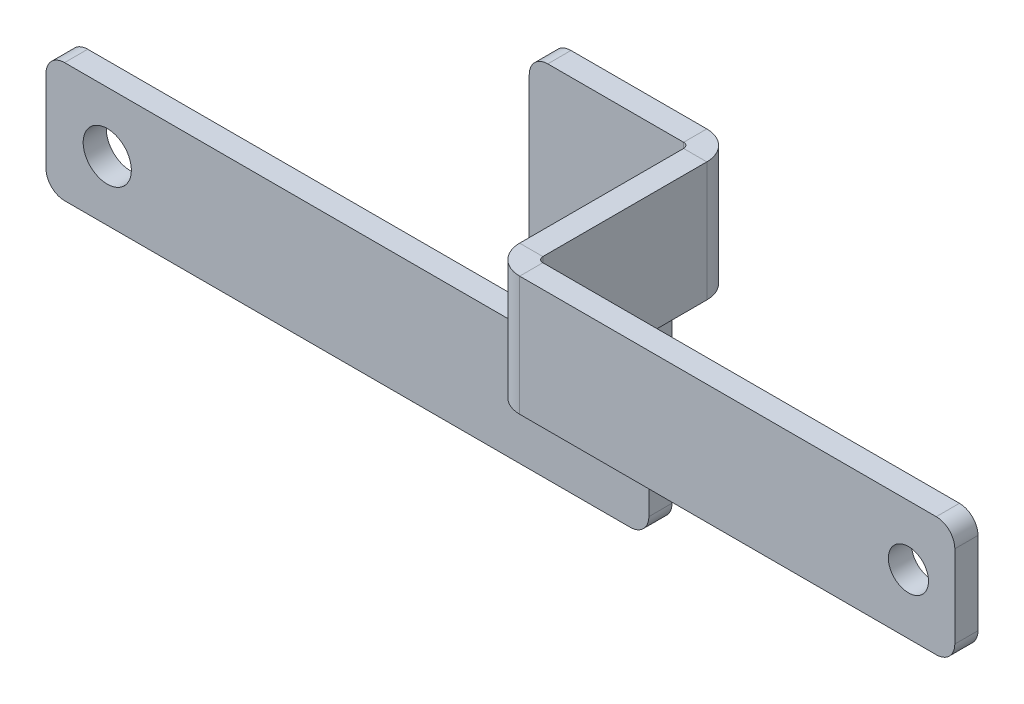
ISO-10303-21;
HEADER;
FILE_DESCRIPTION(('STEP AP214'),'2;1');
FILE_NAME('part.step','',(''),(''),'','','');
FILE_SCHEMA(('AUTOMOTIVE_DESIGN { 1 0 10303 214 1 1 1 1 }'));
ENDSEC;
DATA;
#1=APPLICATION_CONTEXT('core data for automotive mechanical design processes');
#2=APPLICATION_PROTOCOL_DEFINITION('international standard','automotive_design',2000,#1);
#3=PRODUCT_CONTEXT('',#1,'mechanical');
#4=PRODUCT('Part','Part','',(#3));
#5=PRODUCT_RELATED_PRODUCT_CATEGORY('part','',(#4));
#6=PRODUCT_DEFINITION_FORMATION('','',#4);
#7=PRODUCT_DEFINITION_CONTEXT('part definition',#1,'design');
#8=PRODUCT_DEFINITION('design','',#6,#7);
#9=PRODUCT_DEFINITION_SHAPE('','',#8);
#10=(LENGTH_UNIT() NAMED_UNIT(*) SI_UNIT(.MILLI.,.METRE.));
#11=(NAMED_UNIT(*) PLANE_ANGLE_UNIT() SI_UNIT($,.RADIAN.));
#12=(NAMED_UNIT(*) SI_UNIT($,.STERADIAN.) SOLID_ANGLE_UNIT());
#13=UNCERTAINTY_MEASURE_WITH_UNIT(LENGTH_MEASURE(1.E-05),#10,'distance_accuracy_value','');
#14=(GEOMETRIC_REPRESENTATION_CONTEXT(3) GLOBAL_UNCERTAINTY_ASSIGNED_CONTEXT((#13)) GLOBAL_UNIT_ASSIGNED_CONTEXT((#10,
#11,#12)) REPRESENTATION_CONTEXT('',''));
#15=CARTESIAN_POINT('',(0.,0.,0.));
#16=DIRECTION('',(0.,0.,1.));
#17=DIRECTION('',(1.,0.,0.));
#18=AXIS2_PLACEMENT_3D('',#15,#16,#17);
#19=CARTESIAN_POINT('',(65.8241,-45.5626000012021,0.));
#20=DIRECTION('',(0.,1.,0.));
#21=DIRECTION('',(0.,0.,1.));
#22=AXIS2_PLACEMENT_3D('',#19,#20,#21);
#23=PLANE('',#22);
#24=DIRECTION('',(-1.,0.,0.));
#25=VECTOR('',#24,1.);
#26=CARTESIAN_POINT('',(65.8241000000001,-45.5626000012021,23.1902));
#27=LINE('',#26,#25);
#28=CARTESIAN_POINT('',(65.8241000000001,-45.5626000012021,23.1902));
#29=VERTEX_POINT('',#28);
#30=CARTESIAN_POINT('',(62.6491000000001,-45.5626000012021,23.1902));
#31=VERTEX_POINT('',#30);
#32=EDGE_CURVE('E262',#29,#31,#27,.T.);
#33=ORIENTED_EDGE('',*,*,#32,.T.);
#34=DIRECTION('',(0.,0.,1.));
#35=VECTOR('',#34,1.);
#36=CARTESIAN_POINT('',(62.6491,-45.5626000012021,0.));
#37=LINE('',#36,#35);
#38=CARTESIAN_POINT('',(62.6491,-45.562600001202,0.736599999999997));
#39=VERTEX_POINT('',#38);
#40=EDGE_CURVE('E283',#31,#39,#37,.F.);
#41=ORIENTED_EDGE('',*,*,#40,.T.);
#42=DIRECTION('',(-1.,0.,0.));
#43=VECTOR('',#42,1.);
#44=CARTESIAN_POINT('',(65.8241,-45.5626000012021,0.736599999999986));
#45=LINE('',#44,#43);
#46=CARTESIAN_POINT('',(65.8241,-45.562600001202,0.736599999999986));
#47=VERTEX_POINT('',#46);
#48=EDGE_CURVE('E272',#39,#47,#45,.F.);
#49=ORIENTED_EDGE('',*,*,#48,.T.);
#50=DIRECTION('',(0.,0.,-1.));
#51=VECTOR('',#50,1.);
#52=CARTESIAN_POINT('',(65.8241,-45.5626000012021,-2.26544738483615E-13));
#53=LINE('',#52,#51);
#54=EDGE_CURVE('E278',#29,#47,#53,.T.);
#55=ORIENTED_EDGE('',*,*,#54,.F.);
#56=EDGE_LOOP('',(#33,#41,#49,#55));
#57=FACE_BOUND('',#56,.T.);
#58=ADVANCED_FACE('F58',(#57),#23,.F.);
#59=CARTESIAN_POINT('',(65.8241000000001,-29.1846000012021,23.9268));
#60=DIRECTION('',(0.,-1.,0.));
#61=DIRECTION('',(0.,0.,-1.));
#62=AXIS2_PLACEMENT_3D('',#59,#60,#61);
#63=PLANE('',#62);
#64=DIRECTION('',(-1.,0.,0.));
#65=VECTOR('',#64,1.);
#66=CARTESIAN_POINT('',(65.8241000000001,-29.1846000012021,23.1902));
#67=LINE('',#66,#65);
#68=CARTESIAN_POINT('',(65.8241000000001,-29.1846000012021,23.1902));
#69=VERTEX_POINT('',#68);
#70=CARTESIAN_POINT('',(62.6491000000001,-29.1846000012021,23.1902));
#71=VERTEX_POINT('',#70);
#72=EDGE_CURVE('E269',#69,#71,#67,.T.);
#73=ORIENTED_EDGE('',*,*,#72,.F.);
#74=DIRECTION('',(0.,0.,1.));
#75=VECTOR('',#74,1.);
#76=CARTESIAN_POINT('',(65.8241,-29.1846000012021,-2.30776579829644E-13));
#77=LINE('',#76,#75);
#78=CARTESIAN_POINT('',(65.8241,-29.1846000012021,0.736599999999986));
#79=VERTEX_POINT('',#78);
#80=EDGE_CURVE('E274',#79,#69,#77,.T.);
#81=ORIENTED_EDGE('',*,*,#80,.F.);
#82=DIRECTION('',(-1.,0.,0.));
#83=VECTOR('',#82,1.);
#84=CARTESIAN_POINT('',(62.6491,-29.1846000012021,0.736599999999997));
#85=LINE('',#84,#83);
#86=CARTESIAN_POINT('',(62.6491,-29.1846000012021,0.736599999999997));
#87=VERTEX_POINT('',#86);
#88=EDGE_CURVE('E288',#87,#79,#85,.F.);
#89=ORIENTED_EDGE('',*,*,#88,.F.);
#90=DIRECTION('',(0.,0.,-1.));
#91=VECTOR('',#90,1.);
#92=CARTESIAN_POINT('',(62.6491000000001,-29.1846000012021,23.9268));
#93=LINE('',#92,#91);
#94=EDGE_CURVE('E280',#87,#71,#93,.F.);
#95=ORIENTED_EDGE('',*,*,#94,.T.);
#96=EDGE_LOOP('',(#73,#81,#89,#95));
#97=FACE_BOUND('',#96,.T.);
#98=ADVANCED_FACE('F508',(#97),#63,.F.);
#99=CARTESIAN_POINT('',(65.8241,0.,-2.26544738483615E-13));
#100=DIRECTION('',(-1.,0.,0.));
#101=DIRECTION('',(0.,0.,1.));
#102=AXIS2_PLACEMENT_3D('',#99,#100,#101);
#103=PLANE('',#102);
#104=DIRECTION('',(0.,-1.,0.));
#105=VECTOR('',#104,1.);
#106=CARTESIAN_POINT('',(65.8241000000001,-45.5626000012021,23.1902));
#107=LINE('',#106,#105);
#108=EDGE_CURVE('E266',#29,#69,#107,.F.);
#109=ORIENTED_EDGE('',*,*,#108,.F.);
#110=ORIENTED_EDGE('',*,*,#54,.T.);
#111=DIRECTION('',(0.,1.,0.));
#112=VECTOR('',#111,1.);
#113=CARTESIAN_POINT('',(65.8241,-45.5626000012021,0.736599999999986));
#114=LINE('',#113,#112);
#115=EDGE_CURVE('E285',#79,#47,#114,.F.);
#116=ORIENTED_EDGE('',*,*,#115,.F.);
#117=ORIENTED_EDGE('',*,*,#80,.T.);
#118=EDGE_LOOP('',(#109,#110,#116,#117));
#119=FACE_BOUND('',#118,.T.);
#120=ADVANCED_FACE('F505',(#119),#103,.F.);
#121=CARTESIAN_POINT('',(62.6491,0.,-2.15459285232788E-13));
#122=DIRECTION('',(-1.,0.,0.));
#123=DIRECTION('',(0.,0.,1.));
#124=AXIS2_PLACEMENT_3D('',#121,#122,#123);
#125=PLANE('',#124);
#126=ORIENTED_EDGE('',*,*,#40,.F.);
#127=DIRECTION('',(0.,-1.,0.));
#128=VECTOR('',#127,1.);
#129=CARTESIAN_POINT('',(62.6491000000001,-45.5626000012021,23.1902));
#130=LINE('',#129,#128);
#131=EDGE_CURVE('E228',#31,#71,#130,.F.);
#132=ORIENTED_EDGE('',*,*,#131,.T.);
#133=ORIENTED_EDGE('',*,*,#94,.F.);
#134=DIRECTION('',(0.,1.,0.));
#135=VECTOR('',#134,1.);
#136=CARTESIAN_POINT('',(62.6491,-45.5626000012021,0.736599999999997));
#137=LINE('',#136,#135);
#138=EDGE_CURVE('E291',#39,#87,#137,.T.);
#139=ORIENTED_EDGE('',*,*,#138,.F.);
#140=EDGE_LOOP('',(#126,#132,#133,#139));
#141=FACE_BOUND('',#140,.T.);
#142=ADVANCED_FACE('F516',(#141),#125,.T.);
#143=CARTESIAN_POINT('',(-25.39999999,-78.5016000012037,-3.175));
#144=DIRECTION('',(-1.,0.,0.));
#145=DIRECTION('',(0.,0.,1.));
#146=AXIS2_PLACEMENT_3D('',#143,#144,#145);
#147=PLANE('',#146);
#148=DIRECTION('',(0.,-1.,0.));
#149=VECTOR('',#148,1.);
#150=CARTESIAN_POINT('',(-25.39999999,-78.5016000012037,-3.175));
#151=LINE('',#150,#149);
#152=CARTESIAN_POINT('',(-25.39999999,-64.6636000012037,-3.175));
#153=VERTEX_POINT('',#152);
#154=CARTESIAN_POINT('',(-25.39999999,-75.9616000012037,-3.175));
#155=VERTEX_POINT('',#154);
#156=EDGE_CURVE('E307',#153,#155,#151,.T.);
#157=ORIENTED_EDGE('',*,*,#156,.T.);
#158=DIRECTION('',(0.,0.,1.));
#159=VECTOR('',#158,1.);
#160=CARTESIAN_POINT('',(-25.39999999,-75.9616000012037,-3.175));
#161=LINE('',#160,#159);
#162=CARTESIAN_POINT('',(-25.39999999,-75.9616000012037,0.));
#163=VERTEX_POINT('',#162);
#164=EDGE_CURVE('E365',#155,#163,#161,.T.);
#165=ORIENTED_EDGE('',*,*,#164,.T.);
#166=DIRECTION('',(0.,-1.,0.));
#167=VECTOR('',#166,1.);
#168=CARTESIAN_POINT('',(-25.39999999,-78.5016000012037,0.));
#169=LINE('',#168,#167);
#170=CARTESIAN_POINT('',(-25.39999999,-64.6636000012037,0.));
#171=VERTEX_POINT('',#170);
#172=EDGE_CURVE('E298',#171,#163,#169,.T.);
#173=ORIENTED_EDGE('',*,*,#172,.F.);
#174=DIRECTION('',(0.,0.,1.));
#175=VECTOR('',#174,1.);
#176=CARTESIAN_POINT('',(-25.39999999,-64.6636000012037,-3.175));
#177=LINE('',#176,#175);
#178=EDGE_CURVE('E356',#171,#153,#177,.F.);
#179=ORIENTED_EDGE('',*,*,#178,.T.);
#180=EDGE_LOOP('',(#157,#165,#173,#179));
#181=FACE_BOUND('',#180,.T.);
#182=ADVANCED_FACE('F465',(#181),#147,.T.);
#183=CARTESIAN_POINT('',(40.772,-62.1236000012037,-3.175));
#184=DIRECTION('',(0.,1.,0.));
#185=DIRECTION('',(-1.,0.,0.));
#186=AXIS2_PLACEMENT_3D('',#183,#184,#185);
#187=PLANE('',#186);
#188=DIRECTION('',(-1.,0.,0.));
#189=VECTOR('',#188,1.);
#190=CARTESIAN_POINT('',(40.772,-62.1236000012037,-3.175));
#191=LINE('',#190,#189);
#192=CARTESIAN_POINT('',(38.232,-62.1236000012037,-3.175));
#193=VERTEX_POINT('',#192);
#194=CARTESIAN_POINT('',(-22.85999999,-62.1236000012037,-3.175));
#195=VERTEX_POINT('',#194);
#196=EDGE_CURVE('E328',#193,#195,#191,.T.);
#197=ORIENTED_EDGE('',*,*,#196,.T.);
#198=DIRECTION('',(0.,0.,1.));
#199=VECTOR('',#198,1.);
#200=CARTESIAN_POINT('',(-22.85999999,-62.1236000012037,-3.175));
#201=LINE('',#200,#199);
#202=CARTESIAN_POINT('',(-22.85999999,-62.1236000012037,0.));
#203=VERTEX_POINT('',#202);
#204=EDGE_CURVE('E391',#195,#203,#201,.T.);
#205=ORIENTED_EDGE('',*,*,#204,.T.);
#206=DIRECTION('',(-1.,0.,0.));
#207=VECTOR('',#206,1.);
#208=CARTESIAN_POINT('',(40.772,-62.1236000012037,0.));
#209=LINE('',#208,#207);
#210=CARTESIAN_POINT('',(38.232,-62.1236000012037,0.));
#211=VERTEX_POINT('',#210);
#212=EDGE_CURVE('E311',#211,#203,#209,.T.);
#213=ORIENTED_EDGE('',*,*,#212,.F.);
#214=DIRECTION('',(0.,0.,1.));
#215=VECTOR('',#214,1.);
#216=CARTESIAN_POINT('',(38.232,-62.1236000012037,-3.175));
#217=LINE('',#216,#215);
#218=EDGE_CURVE('E389',#211,#193,#217,.F.);
#219=ORIENTED_EDGE('',*,*,#218,.T.);
#220=EDGE_LOOP('',(#197,#205,#213,#219));
#221=FACE_BOUND('',#220,.T.);
#222=ADVANCED_FACE('F474',(#221),#187,.T.);
#223=CARTESIAN_POINT('',(40.772,-45.5626000012021,-3.175));
#224=DIRECTION('',(-1.,0.,0.));
#225=DIRECTION('',(0.,0.,1.));
#226=AXIS2_PLACEMENT_3D('',#223,#224,#225);
#227=PLANE('',#226);
#228=DIRECTION('',(0.,-1.,0.));
#229=VECTOR('',#228,1.);
#230=CARTESIAN_POINT('',(40.772,-29.1846000012021,-3.175));
#231=LINE('',#230,#229);
#232=CARTESIAN_POINT('',(40.772,-31.7246000012021,-3.175));
#233=VERTEX_POINT('',#232);
#234=CARTESIAN_POINT('',(40.772,-59.5836000012037,-3.175));
#235=VERTEX_POINT('',#234);
#236=EDGE_CURVE('E325',#233,#235,#231,.T.);
#237=ORIENTED_EDGE('',*,*,#236,.T.);
#238=DIRECTION('',(0.,0.,1.));
#239=VECTOR('',#238,1.);
#240=CARTESIAN_POINT('',(40.772,-59.5836000012037,0.));
#241=LINE('',#240,#239);
#242=CARTESIAN_POINT('',(40.772,-59.5836000012037,0.));
#243=VERTEX_POINT('',#242);
#244=EDGE_CURVE('E396',#235,#243,#241,.T.);
#245=ORIENTED_EDGE('',*,*,#244,.T.);
#246=DIRECTION('',(0.,-1.,0.));
#247=VECTOR('',#246,1.);
#248=CARTESIAN_POINT('',(40.772,-45.5626000012021,0.));
#249=LINE('',#248,#247);
#250=CARTESIAN_POINT('',(40.772,-31.7246000012021,0.));
#251=VERTEX_POINT('',#250);
#252=EDGE_CURVE('E348',#251,#243,#249,.T.);
#253=ORIENTED_EDGE('',*,*,#252,.F.);
#254=DIRECTION('',(0.,0.,1.));
#255=VECTOR('',#254,1.);
#256=CARTESIAN_POINT('',(40.772,-31.7246000012021,-3.175));
#257=LINE('',#256,#255);
#258=EDGE_CURVE('E394',#251,#233,#257,.F.);
#259=ORIENTED_EDGE('',*,*,#258,.T.);
#260=EDGE_LOOP('',(#237,#245,#253,#259));
#261=FACE_BOUND('',#260,.T.);
#262=ADVANCED_FACE('F483',(#261),#227,.T.);
#263=CARTESIAN_POINT('',(40.772,-29.1846000012021,-3.175));
#264=DIRECTION('',(0.,1.,0.));
#265=DIRECTION('',(0.,0.,1.));
#266=AXIS2_PLACEMENT_3D('',#263,#264,#265);
#267=PLANE('',#266);
#268=DIRECTION('',(-1.,0.,0.));
#269=VECTOR('',#268,1.);
#270=CARTESIAN_POINT('',(40.772,-29.1846000012021,-3.175));
#271=LINE('',#270,#269);
#272=CARTESIAN_POINT('',(61.9125,-29.1846000012021,-3.175));
#273=VERTEX_POINT('',#272);
#274=CARTESIAN_POINT('',(43.312,-29.1846000012021,-3.175));
#275=VERTEX_POINT('',#274);
#276=EDGE_CURVE('E322',#273,#275,#271,.T.);
#277=ORIENTED_EDGE('',*,*,#276,.T.);
#278=DIRECTION('',(0.,0.,1.));
#279=VECTOR('',#278,1.);
#280=CARTESIAN_POINT('',(43.312,-29.1846000012021,-3.175));
#281=LINE('',#280,#279);
#282=CARTESIAN_POINT('',(43.312,-29.1846000012021,0.));
#283=VERTEX_POINT('',#282);
#284=EDGE_CURVE('E406',#275,#283,#281,.T.);
#285=ORIENTED_EDGE('',*,*,#284,.T.);
#286=DIRECTION('',(-1.,0.,0.));
#287=VECTOR('',#286,1.);
#288=CARTESIAN_POINT('',(40.772,-29.1846000012021,0.));
#289=LINE('',#288,#287);
#290=CARTESIAN_POINT('',(61.9125,-29.1846000012021,0.));
#291=VERTEX_POINT('',#290);
#292=EDGE_CURVE('E345',#291,#283,#289,.T.);
#293=ORIENTED_EDGE('',*,*,#292,.F.);
#294=DIRECTION('',(0.,0.,1.));
#295=VECTOR('',#294,1.);
#296=CARTESIAN_POINT('',(61.9125,-29.1846000012021,-3.175));
#297=LINE('',#296,#295);
#298=EDGE_CURVE('E353',#273,#291,#297,.T.);
#299=ORIENTED_EDGE('',*,*,#298,.F.);
#300=EDGE_LOOP('',(#277,#285,#293,#299));
#301=FACE_BOUND('',#300,.T.);
#302=ADVANCED_FACE('F491',(#301),#267,.T.);
#303=CARTESIAN_POINT('',(57.15000001,-45.5626000012021,-3.175));
#304=DIRECTION('',(0.,-1.,0.));
#305=DIRECTION('',(0.,0.,-1.));
#306=AXIS2_PLACEMENT_3D('',#303,#304,#305);
#307=PLANE('',#306);
#308=DIRECTION('',(1.,0.,0.));
#309=VECTOR('',#308,1.);
#310=CARTESIAN_POINT('',(57.15000001,-45.5626000012021,0.));
#311=LINE('',#310,#309);
#312=CARTESIAN_POINT('',(59.69000001,-45.5626000012021,0.));
#313=VERTEX_POINT('',#312);
#314=CARTESIAN_POINT('',(61.9125,-45.5626000012021,0.));
#315=VERTEX_POINT('',#314);
#316=EDGE_CURVE('E340',#313,#315,#311,.T.);
#317=ORIENTED_EDGE('',*,*,#316,.F.);
#318=DIRECTION('',(0.,0.,1.));
#319=VECTOR('',#318,1.);
#320=CARTESIAN_POINT('',(59.69000001,-45.5626000012021,-3.175));
#321=LINE('',#320,#319);
#322=CARTESIAN_POINT('',(59.69000001,-45.5626000012021,-3.175));
#323=VERTEX_POINT('',#322);
#324=EDGE_CURVE('E404',#313,#323,#321,.F.);
#325=ORIENTED_EDGE('',*,*,#324,.T.);
#326=DIRECTION('',(1.,0.,0.));
#327=VECTOR('',#326,1.);
#328=CARTESIAN_POINT('',(57.15000001,-45.5626000012021,-3.175));
#329=LINE('',#328,#327);
#330=CARTESIAN_POINT('',(61.9125,-45.5626000012021,-3.175));
#331=VERTEX_POINT('',#330);
#332=EDGE_CURVE('E317',#323,#331,#329,.T.);
#333=ORIENTED_EDGE('',*,*,#332,.T.);
#334=DIRECTION('',(0.,0.,1.));
#335=VECTOR('',#334,1.);
#336=CARTESIAN_POINT('',(61.9125,-45.5626000012021,-3.175));
#337=LINE('',#336,#335);
#338=EDGE_CURVE('E331',#331,#315,#337,.T.);
#339=ORIENTED_EDGE('',*,*,#338,.T.);
#340=EDGE_LOOP('',(#317,#325,#333,#339));
#341=FACE_BOUND('',#340,.T.);
#342=ADVANCED_FACE('F436',(#341),#307,.T.);
#343=CARTESIAN_POINT('',(57.15000001,-45.5626000012021,-3.175));
#344=DIRECTION('',(1.,0.,0.));
#345=DIRECTION('',(0.,1.,0.));
#346=AXIS2_PLACEMENT_3D('',#343,#344,#345);
#347=PLANE('',#346);
#348=DIRECTION('',(0.,1.,0.));
#349=VECTOR('',#348,1.);
#350=CARTESIAN_POINT('',(57.15000001,-45.5626000012021,0.));
#351=LINE('',#350,#349);
#352=CARTESIAN_POINT('',(57.15000001,-75.9616000012037,0.));
#353=VERTEX_POINT('',#352);
#354=CARTESIAN_POINT('',(57.15000001,-48.1026000012021,0.));
#355=VERTEX_POINT('',#354);
#356=EDGE_CURVE('E337',#353,#355,#351,.T.);
#357=ORIENTED_EDGE('',*,*,#356,.F.);
#358=DIRECTION('',(0.,0.,1.));
#359=VECTOR('',#358,1.);
#360=CARTESIAN_POINT('',(57.15000001,-75.9616000012037,-3.175));
#361=LINE('',#360,#359);
#362=CARTESIAN_POINT('',(57.15000001,-75.9616000012037,-3.175));
#363=VERTEX_POINT('',#362);
#364=EDGE_CURVE('E402',#353,#363,#361,.F.);
#365=ORIENTED_EDGE('',*,*,#364,.T.);
#366=DIRECTION('',(0.,1.,0.));
#367=VECTOR('',#366,1.);
#368=CARTESIAN_POINT('',(57.15000001,-45.5626000012021,-3.175));
#369=LINE('',#368,#367);
#370=CARTESIAN_POINT('',(57.15000001,-48.1026000012021,-3.175));
#371=VERTEX_POINT('',#370);
#372=EDGE_CURVE('E314',#363,#371,#369,.T.);
#373=ORIENTED_EDGE('',*,*,#372,.T.);
#374=DIRECTION('',(0.,0.,1.));
#375=VECTOR('',#374,1.);
#376=CARTESIAN_POINT('',(57.15000001,-48.1026000012021,0.));
#377=LINE('',#376,#375);
#378=EDGE_CURVE('E399',#371,#355,#377,.T.);
#379=ORIENTED_EDGE('',*,*,#378,.T.);
#380=EDGE_LOOP('',(#357,#365,#373,#379));
#381=FACE_BOUND('',#380,.T.);
#382=ADVANCED_FACE('F449',(#381),#347,.T.);
#383=CARTESIAN_POINT('',(57.15000001,-78.5016000012037,-3.175));
#384=DIRECTION('',(0.,-1.,0.));
#385=DIRECTION('',(0.,0.,-1.));
#386=AXIS2_PLACEMENT_3D('',#383,#384,#385);
#387=PLANE('',#386);
#388=DIRECTION('',(1.,0.,0.));
#389=VECTOR('',#388,1.);
#390=CARTESIAN_POINT('',(57.15000001,-78.5016000012037,0.));
#391=LINE('',#390,#389);
#392=CARTESIAN_POINT('',(-22.85999999,-78.5016000012037,0.));
#393=VERTEX_POINT('',#392);
#394=CARTESIAN_POINT('',(54.61000001,-78.5016000012037,0.));
#395=VERTEX_POINT('',#394);
#396=EDGE_CURVE('E334',#393,#395,#391,.T.);
#397=ORIENTED_EDGE('',*,*,#396,.F.);
#398=DIRECTION('',(0.,0.,1.));
#399=VECTOR('',#398,1.);
#400=CARTESIAN_POINT('',(-22.85999999,-78.5016000012037,-3.175));
#401=LINE('',#400,#399);
#402=CARTESIAN_POINT('',(-22.85999999,-78.5016000012037,-3.175));
#403=VERTEX_POINT('',#402);
#404=EDGE_CURVE('E379',#393,#403,#401,.F.);
#405=ORIENTED_EDGE('',*,*,#404,.T.);
#406=DIRECTION('',(1.,0.,0.));
#407=VECTOR('',#406,1.);
#408=CARTESIAN_POINT('',(57.15000001,-78.5016000012037,-3.175));
#409=LINE('',#408,#407);
#410=CARTESIAN_POINT('',(54.61000001,-78.5016000012037,-3.175));
#411=VERTEX_POINT('',#410);
#412=EDGE_CURVE('E310',#403,#411,#409,.T.);
#413=ORIENTED_EDGE('',*,*,#412,.T.);
#414=DIRECTION('',(0.,0.,1.));
#415=VECTOR('',#414,1.);
#416=CARTESIAN_POINT('',(54.61000001,-78.5016000012037,-3.175));
#417=LINE('',#416,#415);
#418=EDGE_CURVE('E376',#411,#395,#417,.T.);
#419=ORIENTED_EDGE('',*,*,#418,.T.);
#420=EDGE_LOOP('',(#397,#405,#413,#419));
#421=FACE_BOUND('',#420,.T.);
#422=ADVANCED_FACE('F457',(#421),#387,.T.);
#423=CARTESIAN_POINT('',(0.,0.,-3.175));
#424=DIRECTION('',(0.,0.,1.));
#425=DIRECTION('',(1.,0.,0.));
#426=AXIS2_PLACEMENT_3D('',#423,#424,#425);
#427=PLANE('',#426);
#428=CARTESIAN_POINT('',(-17.0118999999998,-70.3126000012033,-3.175));
#429=DIRECTION('',(0.,0.,1.));
#430=DIRECTION('',(1.,0.,0.));
#431=AXIS2_PLACEMENT_3D('',#428,#429,#430);
#432=CIRCLE('',#431,3.3);
#433=CARTESIAN_POINT('',(-13.7118999999998,-70.3126000012033,-3.175));
#434=VERTEX_POINT('',#433);
#435=EDGE_CURVE('E584',#434,#434,#432,.T.);
#436=ORIENTED_EDGE('',*,*,#435,.T.);
#437=EDGE_LOOP('',(#436));
#438=FACE_BOUND('',#437,.T.);
#439=ORIENTED_EDGE('',*,*,#412,.F.);
#440=CARTESIAN_POINT('',(-22.85999999,-75.9616000012037,-3.175));
#441=DIRECTION('',(0.,0.,1.));
#442=DIRECTION('',(1.,0.,0.));
#443=AXIS2_PLACEMENT_3D('',#440,#441,#442);
#444=CIRCLE('',#443,2.54);
#445=EDGE_CURVE('E387',#403,#155,#444,.F.);
#446=ORIENTED_EDGE('',*,*,#445,.T.);
#447=ORIENTED_EDGE('',*,*,#156,.F.);
#448=CARTESIAN_POINT('',(-22.85999999,-64.6636000012037,-3.175));
#449=DIRECTION('',(0.,0.,1.));
#450=DIRECTION('',(1.,0.,0.));
#451=AXIS2_PLACEMENT_3D('',#448,#449,#450);
#452=CIRCLE('',#451,2.54);
#453=EDGE_CURVE('E385',#153,#195,#452,.F.);
#454=ORIENTED_EDGE('',*,*,#453,.T.);
#455=ORIENTED_EDGE('',*,*,#196,.F.);
#456=CARTESIAN_POINT('',(38.232,-59.5836000012037,-3.175));
#457=DIRECTION('',(0.,0.,1.));
#458=DIRECTION('',(1.,0.,0.));
#459=AXIS2_PLACEMENT_3D('',#456,#457,#458);
#460=CIRCLE('',#459,2.54);
#461=EDGE_CURVE('E427',#193,#235,#460,.T.);
#462=ORIENTED_EDGE('',*,*,#461,.T.);
#463=ORIENTED_EDGE('',*,*,#236,.F.);
#464=CARTESIAN_POINT('',(43.312,-31.7246000012021,-3.175));
#465=DIRECTION('',(0.,0.,1.));
#466=DIRECTION('',(1.,0.,0.));
#467=AXIS2_PLACEMENT_3D('',#464,#465,#466);
#468=CIRCLE('',#467,2.54);
#469=EDGE_CURVE('E381',#233,#275,#468,.F.);
#470=ORIENTED_EDGE('',*,*,#469,.T.);
#471=ORIENTED_EDGE('',*,*,#276,.F.);
#472=DIRECTION('',(0.,1.,0.));
#473=VECTOR('',#472,1.);
#474=CARTESIAN_POINT('',(61.9125,-45.5626000012021,-3.175));
#475=LINE('',#474,#473);
#476=EDGE_CURVE('E319',#331,#273,#475,.T.);
#477=ORIENTED_EDGE('',*,*,#476,.F.);
#478=ORIENTED_EDGE('',*,*,#332,.F.);
#479=CARTESIAN_POINT('',(59.69000001,-48.1026000012021,-3.175));
#480=DIRECTION('',(0.,0.,1.));
#481=DIRECTION('',(1.,0.,0.));
#482=AXIS2_PLACEMENT_3D('',#479,#480,#481);
#483=CIRCLE('',#482,2.54);
#484=EDGE_CURVE('E13',#323,#371,#483,.T.);
#485=ORIENTED_EDGE('',*,*,#484,.T.);
#486=ORIENTED_EDGE('',*,*,#372,.F.);
#487=CARTESIAN_POINT('',(54.61000001,-75.9616000012037,-3.175));
#488=DIRECTION('',(0.,0.,1.));
#489=DIRECTION('',(1.,0.,0.));
#490=AXIS2_PLACEMENT_3D('',#487,#488,#489);
#491=CIRCLE('',#490,2.54);
#492=EDGE_CURVE('E383',#363,#411,#491,.F.);
#493=ORIENTED_EDGE('',*,*,#492,.T.);
#494=EDGE_LOOP('',(#439,#446,#447,#454,#455,#462,#463,#470,#471,#477,#478,#485,#486,#493));
#495=FACE_BOUND('',#494,.T.);
#496=ADVANCED_FACE('F445',(#438,#495),#427,.F.);
#497=CARTESIAN_POINT('',(0.,0.,0.));
#498=DIRECTION('',(0.,0.,1.));
#499=DIRECTION('',(1.,0.,0.));
#500=AXIS2_PLACEMENT_3D('',#497,#498,#499);
#501=PLANE('',#500);
#502=CARTESIAN_POINT('',(-17.0118999999998,-70.3126000012033,0.));
#503=DIRECTION('',(0.,0.,1.));
#504=DIRECTION('',(1.,0.,0.));
#505=AXIS2_PLACEMENT_3D('',#502,#503,#504);
#506=CIRCLE('',#505,3.3);
#507=CARTESIAN_POINT('',(-13.7118999999998,-70.3126000012033,0.));
#508=VERTEX_POINT('',#507);
#509=EDGE_CURVE('E587',#508,#508,#506,.T.);
#510=ORIENTED_EDGE('',*,*,#509,.F.);
#511=EDGE_LOOP('',(#510));
#512=FACE_BOUND('',#511,.T.);
#513=ORIENTED_EDGE('',*,*,#172,.T.);
#514=CARTESIAN_POINT('',(-22.85999999,-75.9616000012037,0.));
#515=DIRECTION('',(0.,0.,1.));
#516=DIRECTION('',(1.,0.,0.));
#517=AXIS2_PLACEMENT_3D('',#514,#515,#516);
#518=CIRCLE('',#517,2.54);
#519=EDGE_CURVE('E374',#163,#393,#518,.T.);
#520=ORIENTED_EDGE('',*,*,#519,.T.);
#521=ORIENTED_EDGE('',*,*,#396,.T.);
#522=CARTESIAN_POINT('',(54.61000001,-75.9616000012037,0.));
#523=DIRECTION('',(0.,0.,1.));
#524=DIRECTION('',(1.,0.,0.));
#525=AXIS2_PLACEMENT_3D('',#522,#523,#524);
#526=CIRCLE('',#525,2.54);
#527=EDGE_CURVE('E370',#395,#353,#526,.T.);
#528=ORIENTED_EDGE('',*,*,#527,.T.);
#529=ORIENTED_EDGE('',*,*,#356,.T.);
#530=CARTESIAN_POINT('',(59.69000001,-48.1026000012021,0.));
#531=DIRECTION('',(0.,0.,1.));
#532=DIRECTION('',(1.,0.,0.));
#533=AXIS2_PLACEMENT_3D('',#530,#531,#532);
#534=CIRCLE('',#533,2.54);
#535=EDGE_CURVE('E66',#355,#313,#534,.F.);
#536=ORIENTED_EDGE('',*,*,#535,.T.);
#537=ORIENTED_EDGE('',*,*,#316,.T.);
#538=DIRECTION('',(0.,1.,0.));
#539=VECTOR('',#538,1.);
#540=CARTESIAN_POINT('',(61.9125,-45.5626000012021,0.));
#541=LINE('',#540,#539);
#542=EDGE_CURVE('E342',#315,#291,#541,.T.);
#543=ORIENTED_EDGE('',*,*,#542,.T.);
#544=ORIENTED_EDGE('',*,*,#292,.T.);
#545=CARTESIAN_POINT('',(43.312,-31.7246000012021,0.));
#546=DIRECTION('',(0.,0.,1.));
#547=DIRECTION('',(1.,0.,0.));
#548=AXIS2_PLACEMENT_3D('',#545,#546,#547);
#549=CIRCLE('',#548,2.54);
#550=EDGE_CURVE('E368',#283,#251,#549,.T.);
#551=ORIENTED_EDGE('',*,*,#550,.T.);
#552=ORIENTED_EDGE('',*,*,#252,.T.);
#553=CARTESIAN_POINT('',(38.232,-59.5836000012037,0.));
#554=DIRECTION('',(0.,0.,1.));
#555=DIRECTION('',(1.,0.,0.));
#556=AXIS2_PLACEMENT_3D('',#553,#554,#555);
#557=CIRCLE('',#556,2.54);
#558=EDGE_CURVE('E425',#243,#211,#557,.F.);
#559=ORIENTED_EDGE('',*,*,#558,.T.);
#560=ORIENTED_EDGE('',*,*,#212,.T.);
#561=CARTESIAN_POINT('',(-22.85999999,-64.6636000012037,0.));
#562=DIRECTION('',(0.,0.,1.));
#563=DIRECTION('',(1.,0.,0.));
#564=AXIS2_PLACEMENT_3D('',#561,#562,#563);
#565=CIRCLE('',#564,2.54);
#566=EDGE_CURVE('E372',#203,#171,#565,.T.);
#567=ORIENTED_EDGE('',*,*,#566,.T.);
#568=EDGE_LOOP('',(#513,#520,#521,#528,#529,#536,#537,#543,#544,#551,#552,#559,#560,#567));
#569=FACE_BOUND('',#568,.T.);
#570=ADVANCED_FACE('F430',(#512,#569),#501,.T.);
#571=CARTESIAN_POINT('',(61.9125,-45.5626000012021,0.7366));
#572=DIRECTION('',(0.,-1.,0.));
#573=DIRECTION('',(0.,0.,-1.));
#574=AXIS2_PLACEMENT_3D('',#571,#572,#573);
#575=PLANE('',#574);
#576=ORIENTED_EDGE('',*,*,#48,.F.);
#577=CARTESIAN_POINT('',(61.9125,-45.5626000012021,0.7366));
#578=DIRECTION('',(0.,1.,0.));
#579=DIRECTION('',(0.,0.,1.));
#580=AXIS2_PLACEMENT_3D('',#577,#578,#579);
#581=CIRCLE('',#580,0.736599999999997);
#582=EDGE_CURVE('E302',#315,#39,#581,.F.);
#583=ORIENTED_EDGE('',*,*,#582,.F.);
#584=ORIENTED_EDGE('',*,*,#338,.F.);
#585=CARTESIAN_POINT('',(61.9125,-45.562600001202,0.7366));
#586=DIRECTION('',(0.,1.,0.));
#587=DIRECTION('',(0.,0.,1.));
#588=AXIS2_PLACEMENT_3D('',#585,#586,#587);
#589=CIRCLE('',#588,3.9116);
#590=EDGE_CURVE('E295',#331,#47,#589,.F.);
#591=ORIENTED_EDGE('',*,*,#590,.T.);
#592=EDGE_LOOP('',(#576,#583,#584,#591));
#593=FACE_BOUND('',#592,.T.);
#594=ADVANCED_FACE('F522',(#593),#575,.T.);
#595=CARTESIAN_POINT('',(61.9125,-29.1846000012021,0.7366));
#596=DIRECTION('',(0.,-1.,0.));
#597=DIRECTION('',(0.,0.,-1.));
#598=AXIS2_PLACEMENT_3D('',#595,#596,#597);
#599=PLANE('',#598);
#600=CARTESIAN_POINT('',(61.9125,-29.1846000012021,0.7366));
#601=DIRECTION('',(0.,1.,0.));
#602=DIRECTION('',(0.,0.,1.));
#603=AXIS2_PLACEMENT_3D('',#600,#601,#602);
#604=CIRCLE('',#603,0.736599999999997);
#605=EDGE_CURVE('E277',#87,#291,#604,.T.);
#606=ORIENTED_EDGE('',*,*,#605,.F.);
#607=ORIENTED_EDGE('',*,*,#88,.T.);
#608=CARTESIAN_POINT('',(61.9125,-29.1846000012021,0.7366));
#609=DIRECTION('',(0.,1.,0.));
#610=DIRECTION('',(0.,0.,1.));
#611=AXIS2_PLACEMENT_3D('',#608,#609,#610);
#612=CIRCLE('',#611,3.9116);
#613=EDGE_CURVE('E299',#79,#273,#612,.T.);
#614=ORIENTED_EDGE('',*,*,#613,.T.);
#615=ORIENTED_EDGE('',*,*,#298,.T.);
#616=EDGE_LOOP('',(#606,#607,#614,#615));
#617=FACE_BOUND('',#616,.T.);
#618=ADVANCED_FACE('F497',(#617),#599,.F.);
#619=CARTESIAN_POINT('',(61.9125,-29.1846000012021,0.7366));
#620=DIRECTION('',(0.,1.,0.));
#621=DIRECTION('',(1.,0.,0.));
#622=AXIS2_PLACEMENT_3D('',#619,#620,#621);
#623=CYLINDRICAL_SURFACE('',#622,3.9116);
#624=ORIENTED_EDGE('',*,*,#476,.T.);
#625=ORIENTED_EDGE('',*,*,#613,.F.);
#626=ORIENTED_EDGE('',*,*,#115,.T.);
#627=ORIENTED_EDGE('',*,*,#590,.F.);
#628=EDGE_LOOP('',(#624,#625,#626,#627));
#629=FACE_BOUND('',#628,.T.);
#630=ADVANCED_FACE('F496',(#629),#623,.T.);
#631=CARTESIAN_POINT('',(61.9125,-29.1846000012021,0.7366));
#632=DIRECTION('',(0.,1.,0.));
#633=DIRECTION('',(1.,0.,0.));
#634=AXIS2_PLACEMENT_3D('',#631,#632,#633);
#635=CYLINDRICAL_SURFACE('',#634,0.736599999999997);
#636=ORIENTED_EDGE('',*,*,#542,.F.);
#637=ORIENTED_EDGE('',*,*,#582,.T.);
#638=ORIENTED_EDGE('',*,*,#138,.T.);
#639=ORIENTED_EDGE('',*,*,#605,.T.);
#640=EDGE_LOOP('',(#636,#637,#638,#639));
#641=FACE_BOUND('',#640,.T.);
#642=ADVANCED_FACE('F524',(#641),#635,.F.);
#643=CARTESIAN_POINT('',(66.5607000000001,-29.1846000012021,23.1902));
#644=DIRECTION('',(0.,1.,0.));
#645=DIRECTION('',(0.,0.,1.));
#646=AXIS2_PLACEMENT_3D('',#643,#644,#645);
#647=PLANE('',#646);
#648=DIRECTION('',(0.,0.,1.));
#649=VECTOR('',#648,1.);
#650=CARTESIAN_POINT('',(66.5607000000001,-29.1846000012021,23.9268));
#651=LINE('',#650,#649);
#652=CARTESIAN_POINT('',(66.5607000000001,-29.1846000012021,23.9268));
#653=VERTEX_POINT('',#652);
#654=CARTESIAN_POINT('',(66.5607000000001,-29.1846000012021,27.1018));
#655=VERTEX_POINT('',#654);
#656=EDGE_CURVE('E362',#653,#655,#651,.T.);
#657=ORIENTED_EDGE('',*,*,#656,.F.);
#658=CARTESIAN_POINT('',(66.5607000000001,-29.1846000012021,23.1902));
#659=DIRECTION('',(0.,-1.,0.));
#660=DIRECTION('',(0.,0.,-1.));
#661=AXIS2_PLACEMENT_3D('',#658,#659,#660);
#662=CIRCLE('',#661,0.736600000000004);
#663=EDGE_CURVE('E231',#69,#653,#662,.F.);
#664=ORIENTED_EDGE('',*,*,#663,.F.);
#665=ORIENTED_EDGE('',*,*,#72,.T.);
#666=CARTESIAN_POINT('',(66.5607000000001,-29.1846000012021,23.1902));
#667=DIRECTION('',(0.,-1.,0.));
#668=DIRECTION('',(0.,0.,-1.));
#669=AXIS2_PLACEMENT_3D('',#666,#667,#668);
#670=CIRCLE('',#669,3.9116);
#671=EDGE_CURVE('E261',#71,#655,#670,.F.);
#672=ORIENTED_EDGE('',*,*,#671,.T.);
#673=EDGE_LOOP('',(#657,#664,#665,#672));
#674=FACE_BOUND('',#673,.T.);
#675=ADVANCED_FACE('F512',(#674),#647,.T.);
#676=CARTESIAN_POINT('',(66.5607000000001,-45.5626000012021,23.1902));
#677=DIRECTION('',(0.,1.,0.));
#678=DIRECTION('',(0.,0.,1.));
#679=AXIS2_PLACEMENT_3D('',#676,#677,#678);
#680=PLANE('',#679);
#681=CARTESIAN_POINT('',(66.5607000000001,-45.5626000012021,23.1902));
#682=DIRECTION('',(0.,-1.,0.));
#683=DIRECTION('',(0.,0.,-1.));
#684=AXIS2_PLACEMENT_3D('',#681,#682,#683);
#685=CIRCLE('',#684,0.736600000000004);
#686=CARTESIAN_POINT('',(66.5607000000001,-45.5626000012021,23.9268));
#687=VERTEX_POINT('',#686);
#688=EDGE_CURVE('E238',#687,#29,#685,.T.);
#689=ORIENTED_EDGE('',*,*,#688,.F.);
#690=DIRECTION('',(0.,0.,1.));
#691=VECTOR('',#690,1.);
#692=CARTESIAN_POINT('',(66.5607000000001,-45.5626000012021,23.9268));
#693=LINE('',#692,#691);
#694=CARTESIAN_POINT('',(66.5607000000001,-45.5626000012021,27.1018));
#695=VERTEX_POINT('',#694);
#696=EDGE_CURVE('E235',#687,#695,#693,.T.);
#697=ORIENTED_EDGE('',*,*,#696,.T.);
#698=CARTESIAN_POINT('',(66.5607000000001,-45.5626000012021,23.1902));
#699=DIRECTION('',(0.,-1.,0.));
#700=DIRECTION('',(0.,0.,-1.));
#701=AXIS2_PLACEMENT_3D('',#698,#699,#700);
#702=CIRCLE('',#701,3.9116);
#703=EDGE_CURVE('E221',#695,#31,#702,.T.);
#704=ORIENTED_EDGE('',*,*,#703,.T.);
#705=ORIENTED_EDGE('',*,*,#32,.F.);
#706=EDGE_LOOP('',(#689,#697,#704,#705));
#707=FACE_BOUND('',#706,.T.);
#708=ADVANCED_FACE('F236',(#707),#680,.F.);
#709=CARTESIAN_POINT('',(66.5607000000001,-45.5626000012021,23.1902));
#710=DIRECTION('',(0.,-1.,0.));
#711=DIRECTION('',(0.,0.,1.));
#712=AXIS2_PLACEMENT_3D('',#709,#710,#711);
#713=CYLINDRICAL_SURFACE('',#712,3.9116);
#714=ORIENTED_EDGE('',*,*,#131,.F.);
#715=ORIENTED_EDGE('',*,*,#703,.F.);
#716=DIRECTION('',(0.,1.,0.));
#717=VECTOR('',#716,1.);
#718=CARTESIAN_POINT('',(66.5607000000001,0.,27.1018));
#719=LINE('',#718,#717);
#720=EDGE_CURVE('E225',#695,#655,#719,.T.);
#721=ORIENTED_EDGE('',*,*,#720,.T.);
#722=ORIENTED_EDGE('',*,*,#671,.F.);
#723=EDGE_LOOP('',(#714,#715,#721,#722));
#724=FACE_BOUND('',#723,.T.);
#725=ADVANCED_FACE('F223',(#724),#713,.T.);
#726=CARTESIAN_POINT('',(66.5607000000001,-45.5626000012021,23.1902));
#727=DIRECTION('',(0.,-1.,0.));
#728=DIRECTION('',(0.,0.,1.));
#729=AXIS2_PLACEMENT_3D('',#726,#727,#728);
#730=CYLINDRICAL_SURFACE('',#729,0.736600000000004);
#731=ORIENTED_EDGE('',*,*,#108,.T.);
#732=ORIENTED_EDGE('',*,*,#663,.T.);
#733=DIRECTION('',(0.,-1.,0.));
#734=VECTOR('',#733,1.);
#735=CARTESIAN_POINT('',(66.5607000000001,-29.1846000012021,23.9268));
#736=LINE('',#735,#734);
#737=EDGE_CURVE('E240',#653,#687,#736,.T.);
#738=ORIENTED_EDGE('',*,*,#737,.T.);
#739=ORIENTED_EDGE('',*,*,#688,.T.);
#740=EDGE_LOOP('',(#731,#732,#738,#739));
#741=FACE_BOUND('',#740,.T.);
#742=ADVANCED_FACE('F547',(#741),#730,.F.);
#743=CARTESIAN_POINT('',(65.8241000000001,-29.1846000012021,27.1018));
#744=DIRECTION('',(0.,-1.,0.));
#745=DIRECTION('',(0.,0.,-1.));
#746=AXIS2_PLACEMENT_3D('',#743,#744,#745);
#747=PLANE('',#746);
#748=DIRECTION('',(-1.,0.,0.));
#749=VECTOR('',#748,1.);
#750=CARTESIAN_POINT('',(65.8241000000001,-29.1846000012021,27.1018));
#751=LINE('',#750,#749);
#752=CARTESIAN_POINT('',(123.6091,-29.1846000012021,27.1018));
#753=VERTEX_POINT('',#752);
#754=EDGE_CURVE('E245',#753,#655,#751,.T.);
#755=ORIENTED_EDGE('',*,*,#754,.F.);
#756=DIRECTION('',(0.,0.,-1.));
#757=VECTOR('',#756,1.);
#758=CARTESIAN_POINT('',(123.6091,-29.1846000012021,27.1018));
#759=LINE('',#758,#757);
#760=CARTESIAN_POINT('',(123.6091,-29.1846000012021,23.9268));
#761=VERTEX_POINT('',#760);
#762=EDGE_CURVE('E422',#753,#761,#759,.T.);
#763=ORIENTED_EDGE('',*,*,#762,.T.);
#764=DIRECTION('',(-1.,0.,0.));
#765=VECTOR('',#764,1.);
#766=CARTESIAN_POINT('',(65.8241000000001,-29.1846000012021,23.9268));
#767=LINE('',#766,#765);
#768=EDGE_CURVE('E246',#761,#653,#767,.T.);
#769=ORIENTED_EDGE('',*,*,#768,.T.);
#770=ORIENTED_EDGE('',*,*,#656,.T.);
#771=EDGE_LOOP('',(#755,#763,#769,#770));
#772=FACE_BOUND('',#771,.T.);
#773=ADVANCED_FACE('F550',(#772),#747,.F.);
#774=CARTESIAN_POINT('',(126.1491,-45.5626000012021,27.1018));
#775=DIRECTION('',(0.,1.,0.));
#776=DIRECTION('',(0.,0.,1.));
#777=AXIS2_PLACEMENT_3D('',#774,#775,#776);
#778=PLANE('',#777);
#779=DIRECTION('',(1.,0.,0.));
#780=VECTOR('',#779,1.);
#781=CARTESIAN_POINT('',(126.1491,-45.5626000012021,23.9268));
#782=LINE('',#781,#780);
#783=CARTESIAN_POINT('',(123.6091,-45.5626000012021,23.9268));
#784=VERTEX_POINT('',#783);
#785=EDGE_CURVE('E256',#687,#784,#782,.T.);
#786=ORIENTED_EDGE('',*,*,#785,.T.);
#787=DIRECTION('',(0.,0.,-1.));
#788=VECTOR('',#787,1.);
#789=CARTESIAN_POINT('',(123.6091,-45.5626000012021,27.1018));
#790=LINE('',#789,#788);
#791=CARTESIAN_POINT('',(123.6091,-45.5626000012021,27.1018));
#792=VERTEX_POINT('',#791);
#793=EDGE_CURVE('E81',#784,#792,#790,.F.);
#794=ORIENTED_EDGE('',*,*,#793,.T.);
#795=DIRECTION('',(1.,0.,0.));
#796=VECTOR('',#795,1.);
#797=CARTESIAN_POINT('',(126.1491,-45.5626000012021,27.1018));
#798=LINE('',#797,#796);
#799=EDGE_CURVE('E243',#695,#792,#798,.T.);
#800=ORIENTED_EDGE('',*,*,#799,.F.);
#801=ORIENTED_EDGE('',*,*,#696,.F.);
#802=EDGE_LOOP('',(#786,#794,#800,#801));
#803=FACE_BOUND('',#802,.T.);
#804=ADVANCED_FACE('F248',(#803),#778,.F.);
#805=CARTESIAN_POINT('',(0.,0.,27.1018));
#806=DIRECTION('',(0.,0.,-1.));
#807=DIRECTION('',(-1.,0.,0.));
#808=AXIS2_PLACEMENT_3D('',#805,#806,#807);
#809=PLANE('',#808);
#810=CARTESIAN_POINT('',(119.7991,-37.373600001202,27.1018));
#811=DIRECTION('',(0.,0.,1.));
#812=DIRECTION('',(1.,0.,0.));
#813=AXIS2_PLACEMENT_3D('',#810,#811,#812);
#814=CIRCLE('',#813,2.75);
#815=CARTESIAN_POINT('',(122.5491,-37.373600001202,27.1018));
#816=VERTEX_POINT('',#815);
#817=EDGE_CURVE('E363',#816,#816,#814,.T.);
#818=ORIENTED_EDGE('',*,*,#817,.F.);
#819=EDGE_LOOP('',(#818));
#820=FACE_BOUND('',#819,.T.);
#821=ORIENTED_EDGE('',*,*,#799,.T.);
#822=CARTESIAN_POINT('',(123.6091,-43.0226000012021,27.1018));
#823=DIRECTION('',(0.,0.,-1.));
#824=DIRECTION('',(-1.,0.,0.));
#825=AXIS2_PLACEMENT_3D('',#822,#823,#824);
#826=CIRCLE('',#825,2.54);
#827=CARTESIAN_POINT('',(126.1491,-43.0226000012021,27.1018));
#828=VERTEX_POINT('',#827);
#829=EDGE_CURVE('E420',#792,#828,#826,.F.);
#830=ORIENTED_EDGE('',*,*,#829,.T.);
#831=DIRECTION('',(0.,1.,0.));
#832=VECTOR('',#831,1.);
#833=CARTESIAN_POINT('',(126.1491,-29.1846000012021,27.1018));
#834=LINE('',#833,#832);
#835=CARTESIAN_POINT('',(126.1491,-31.7246000012021,27.1018));
#836=VERTEX_POINT('',#835);
#837=EDGE_CURVE('E249',#828,#836,#834,.T.);
#838=ORIENTED_EDGE('',*,*,#837,.T.);
#839=CARTESIAN_POINT('',(123.6091,-31.7246000012021,27.1018));
#840=DIRECTION('',(0.,0.,-1.));
#841=DIRECTION('',(-1.,0.,0.));
#842=AXIS2_PLACEMENT_3D('',#839,#840,#841);
#843=CIRCLE('',#842,2.54);
#844=EDGE_CURVE('E73',#836,#753,#843,.F.);
#845=ORIENTED_EDGE('',*,*,#844,.T.);
#846=ORIENTED_EDGE('',*,*,#754,.T.);
#847=ORIENTED_EDGE('',*,*,#720,.F.);
#848=EDGE_LOOP('',(#821,#830,#838,#845,#846,#847));
#849=FACE_BOUND('',#848,.T.);
#850=ADVANCED_FACE('F242',(#820,#849),#809,.F.);
#851=CARTESIAN_POINT('',(0.,0.,23.9268));
#852=DIRECTION('',(0.,0.,-1.));
#853=DIRECTION('',(-1.,0.,0.));
#854=AXIS2_PLACEMENT_3D('',#851,#852,#853);
#855=PLANE('',#854);
#856=CARTESIAN_POINT('',(119.7991,-37.373600001202,23.9268));
#857=DIRECTION('',(0.,0.,-1.));
#858=DIRECTION('',(-1.,0.,0.));
#859=AXIS2_PLACEMENT_3D('',#856,#857,#858);
#860=CIRCLE('',#859,2.75);
#861=CARTESIAN_POINT('',(117.0491,-37.373600001202,23.9268));
#862=VERTEX_POINT('',#861);
#863=EDGE_CURVE('E359',#862,#862,#860,.T.);
#864=ORIENTED_EDGE('',*,*,#863,.F.);
#865=EDGE_LOOP('',(#864));
#866=FACE_BOUND('',#865,.T.);
#867=DIRECTION('',(0.,1.,0.));
#868=VECTOR('',#867,1.);
#869=CARTESIAN_POINT('',(126.1491,-29.1846000012021,23.9268));
#870=LINE('',#869,#868);
#871=CARTESIAN_POINT('',(126.1491,-43.0226000012021,23.9268));
#872=VERTEX_POINT('',#871);
#873=CARTESIAN_POINT('',(126.1491,-31.7246000012021,23.9268));
#874=VERTEX_POINT('',#873);
#875=EDGE_CURVE('E252',#872,#874,#870,.T.);
#876=ORIENTED_EDGE('',*,*,#875,.F.);
#877=CARTESIAN_POINT('',(123.6091,-43.0226000012021,23.9268));
#878=DIRECTION('',(0.,0.,-1.));
#879=DIRECTION('',(-1.,0.,0.));
#880=AXIS2_PLACEMENT_3D('',#877,#878,#879);
#881=CIRCLE('',#880,2.54);
#882=EDGE_CURVE('E416',#872,#784,#881,.T.);
#883=ORIENTED_EDGE('',*,*,#882,.T.);
#884=ORIENTED_EDGE('',*,*,#785,.F.);
#885=ORIENTED_EDGE('',*,*,#737,.F.);
#886=ORIENTED_EDGE('',*,*,#768,.F.);
#887=CARTESIAN_POINT('',(123.6091,-31.7246000012021,23.9268));
#888=DIRECTION('',(0.,0.,-1.));
#889=DIRECTION('',(-1.,0.,0.));
#890=AXIS2_PLACEMENT_3D('',#887,#888,#889);
#891=CIRCLE('',#890,2.54);
#892=EDGE_CURVE('E414',#761,#874,#891,.T.);
#893=ORIENTED_EDGE('',*,*,#892,.T.);
#894=EDGE_LOOP('',(#876,#883,#884,#885,#886,#893));
#895=FACE_BOUND('',#894,.T.);
#896=ADVANCED_FACE('F563',(#866,#895),#855,.T.);
#897=CARTESIAN_POINT('',(126.1491,-29.1846000012021,27.1018));
#898=DIRECTION('',(-1.,0.,0.));
#899=DIRECTION('',(0.,0.,1.));
#900=AXIS2_PLACEMENT_3D('',#897,#898,#899);
#901=PLANE('',#900);
#902=ORIENTED_EDGE('',*,*,#837,.F.);
#903=DIRECTION('',(0.,0.,-1.));
#904=VECTOR('',#903,1.);
#905=CARTESIAN_POINT('',(126.1491,-43.0226000012021,27.1018));
#906=LINE('',#905,#904);
#907=EDGE_CURVE('E411',#828,#872,#906,.T.);
#908=ORIENTED_EDGE('',*,*,#907,.T.);
#909=ORIENTED_EDGE('',*,*,#875,.T.);
#910=DIRECTION('',(0.,0.,-1.));
#911=VECTOR('',#910,1.);
#912=CARTESIAN_POINT('',(126.1491,-31.7246000012021,27.1018));
#913=LINE('',#912,#911);
#914=EDGE_CURVE('E409',#874,#836,#913,.F.);
#915=ORIENTED_EDGE('',*,*,#914,.T.);
#916=EDGE_LOOP('',(#902,#908,#909,#915));
#917=FACE_BOUND('',#916,.T.);
#918=ADVANCED_FACE('F559',(#917),#901,.F.);
#919=CARTESIAN_POINT('',(119.7991,-37.373600001202,27.1018));
#920=DIRECTION('',(0.,0.,1.));
#921=DIRECTION('',(1.,0.,0.));
#922=AXIS2_PLACEMENT_3D('',#919,#920,#921);
#923=CYLINDRICAL_SURFACE('',#922,2.75);
#924=ORIENTED_EDGE('',*,*,#863,.T.);
#925=EDGE_LOOP('',(#924));
#926=FACE_BOUND('',#925,.T.);
#927=ORIENTED_EDGE('',*,*,#817,.T.);
#928=EDGE_LOOP('',(#927));
#929=FACE_BOUND('',#928,.T.);
#930=ADVANCED_FACE('F562',(#926,#929),#923,.F.);
#931=CARTESIAN_POINT('',(-17.0118999999998,-70.3126000012033,0.));
#932=DIRECTION('',(0.,0.,1.));
#933=DIRECTION('',(1.,0.,0.));
#934=AXIS2_PLACEMENT_3D('',#931,#932,#933);
#935=CYLINDRICAL_SURFACE('',#934,3.3);
#936=ORIENTED_EDGE('',*,*,#435,.F.);
#937=EDGE_LOOP('',(#936));
#938=FACE_BOUND('',#937,.T.);
#939=ORIENTED_EDGE('',*,*,#509,.T.);
#940=EDGE_LOOP('',(#939));
#941=FACE_BOUND('',#940,.T.);
#942=ADVANCED_FACE('F573',(#938,#941),#935,.F.);
#943=CARTESIAN_POINT('',(-22.85999999,-75.9616000012037,-3.175));
#944=DIRECTION('',(0.,0.,1.));
#945=DIRECTION('',(1.,0.,0.));
#946=AXIS2_PLACEMENT_3D('',#943,#944,#945);
#947=CYLINDRICAL_SURFACE('',#946,2.54);
#948=ORIENTED_EDGE('',*,*,#445,.F.);
#949=ORIENTED_EDGE('',*,*,#404,.F.);
#950=ORIENTED_EDGE('',*,*,#519,.F.);
#951=ORIENTED_EDGE('',*,*,#164,.F.);
#952=EDGE_LOOP('',(#948,#949,#950,#951));
#953=FACE_BOUND('',#952,.T.);
#954=ADVANCED_FACE('F460',(#953),#947,.T.);
#955=CARTESIAN_POINT('',(-22.85999999,-64.6636000012037,-3.175));
#956=DIRECTION('',(0.,0.,1.));
#957=DIRECTION('',(1.,0.,0.));
#958=AXIS2_PLACEMENT_3D('',#955,#956,#957);
#959=CYLINDRICAL_SURFACE('',#958,2.54);
#960=ORIENTED_EDGE('',*,*,#453,.F.);
#961=ORIENTED_EDGE('',*,*,#178,.F.);
#962=ORIENTED_EDGE('',*,*,#566,.F.);
#963=ORIENTED_EDGE('',*,*,#204,.F.);
#964=EDGE_LOOP('',(#960,#961,#962,#963));
#965=FACE_BOUND('',#964,.T.);
#966=ADVANCED_FACE('F469',(#965),#959,.T.);
#967=CARTESIAN_POINT('',(38.232,-59.5836000012037,-3.175));
#968=DIRECTION('',(0.,0.,-1.));
#969=DIRECTION('',(-1.,0.,0.));
#970=AXIS2_PLACEMENT_3D('',#967,#968,#969);
#971=CYLINDRICAL_SURFACE('',#970,2.54);
#972=ORIENTED_EDGE('',*,*,#461,.F.);
#973=ORIENTED_EDGE('',*,*,#218,.F.);
#974=ORIENTED_EDGE('',*,*,#558,.F.);
#975=ORIENTED_EDGE('',*,*,#244,.F.);
#976=EDGE_LOOP('',(#972,#973,#974,#975));
#977=FACE_BOUND('',#976,.T.);
#978=ADVANCED_FACE('F478',(#977),#971,.F.);
#979=CARTESIAN_POINT('',(54.61000001,-75.9616000012037,-3.175));
#980=DIRECTION('',(0.,0.,1.));
#981=DIRECTION('',(1.,0.,0.));
#982=AXIS2_PLACEMENT_3D('',#979,#980,#981);
#983=CYLINDRICAL_SURFACE('',#982,2.54);
#984=ORIENTED_EDGE('',*,*,#492,.F.);
#985=ORIENTED_EDGE('',*,*,#364,.F.);
#986=ORIENTED_EDGE('',*,*,#527,.F.);
#987=ORIENTED_EDGE('',*,*,#418,.F.);
#988=EDGE_LOOP('',(#984,#985,#986,#987));
#989=FACE_BOUND('',#988,.T.);
#990=ADVANCED_FACE('F452',(#989),#983,.T.);
#991=CARTESIAN_POINT('',(59.69000001,-48.1026000012021,-3.175));
#992=DIRECTION('',(0.,0.,-1.));
#993=DIRECTION('',(-1.,0.,0.));
#994=AXIS2_PLACEMENT_3D('',#991,#992,#993);
#995=CYLINDRICAL_SURFACE('',#994,2.54);
#996=ORIENTED_EDGE('',*,*,#484,.F.);
#997=ORIENTED_EDGE('',*,*,#324,.F.);
#998=ORIENTED_EDGE('',*,*,#535,.F.);
#999=ORIENTED_EDGE('',*,*,#378,.F.);
#1000=EDGE_LOOP('',(#996,#997,#998,#999));
#1001=FACE_BOUND('',#1000,.T.);
#1002=ADVANCED_FACE('F441',(#1001),#995,.F.);
#1003=CARTESIAN_POINT('',(43.312,-31.7246000012021,-3.175));
#1004=DIRECTION('',(0.,0.,1.));
#1005=DIRECTION('',(1.,0.,0.));
#1006=AXIS2_PLACEMENT_3D('',#1003,#1004,#1005);
#1007=CYLINDRICAL_SURFACE('',#1006,2.54);
#1008=ORIENTED_EDGE('',*,*,#469,.F.);
#1009=ORIENTED_EDGE('',*,*,#258,.F.);
#1010=ORIENTED_EDGE('',*,*,#550,.F.);
#1011=ORIENTED_EDGE('',*,*,#284,.F.);
#1012=EDGE_LOOP('',(#1008,#1009,#1010,#1011));
#1013=FACE_BOUND('',#1012,.T.);
#1014=ADVANCED_FACE('F487',(#1013),#1007,.T.);
#1015=CARTESIAN_POINT('',(123.6091,-43.0226000012021,27.1018));
#1016=DIRECTION('',(0.,0.,-1.));
#1017=DIRECTION('',(-1.,0.,0.));
#1018=AXIS2_PLACEMENT_3D('',#1015,#1016,#1017);
#1019=CYLINDRICAL_SURFACE('',#1018,2.54);
#1020=ORIENTED_EDGE('',*,*,#829,.F.);
#1021=ORIENTED_EDGE('',*,*,#793,.F.);
#1022=ORIENTED_EDGE('',*,*,#882,.F.);
#1023=ORIENTED_EDGE('',*,*,#907,.F.);
#1024=EDGE_LOOP('',(#1020,#1021,#1022,#1023));
#1025=FACE_BOUND('',#1024,.T.);
#1026=ADVANCED_FACE('F601',(#1025),#1019,.T.);
#1027=CARTESIAN_POINT('',(123.6091,-31.7246000012021,27.1018));
#1028=DIRECTION('',(0.,0.,-1.));
#1029=DIRECTION('',(-1.,0.,0.));
#1030=AXIS2_PLACEMENT_3D('',#1027,#1028,#1029);
#1031=CYLINDRICAL_SURFACE('',#1030,2.54);
#1032=ORIENTED_EDGE('',*,*,#844,.F.);
#1033=ORIENTED_EDGE('',*,*,#914,.F.);
#1034=ORIENTED_EDGE('',*,*,#892,.F.);
#1035=ORIENTED_EDGE('',*,*,#762,.F.);
#1036=EDGE_LOOP('',(#1032,#1033,#1034,#1035));
#1037=FACE_BOUND('',#1036,.T.);
#1038=ADVANCED_FACE('F60',(#1037),#1031,.T.);
#1039=CLOSED_SHELL('',(#58,#98,#120,#142,#182,#222,#262,#302,#342,#382,#422,#496,#570,#594,#618,
#630,#642,#675,#708,#725,#742,#773,#804,#850,#896,#918,#930,#942,#954,#966,#978,#990,#1002,
#1014,#1026,#1038));
#1040=MANIFOLD_SOLID_BREP('B2',#1039);
#1041=ADVANCED_BREP_SHAPE_REPRESENTATION('',(#18,#1040),#14);
#1042=SHAPE_DEFINITION_REPRESENTATION(#9,#1041);
ENDSEC;
END-ISO-10303-21;
